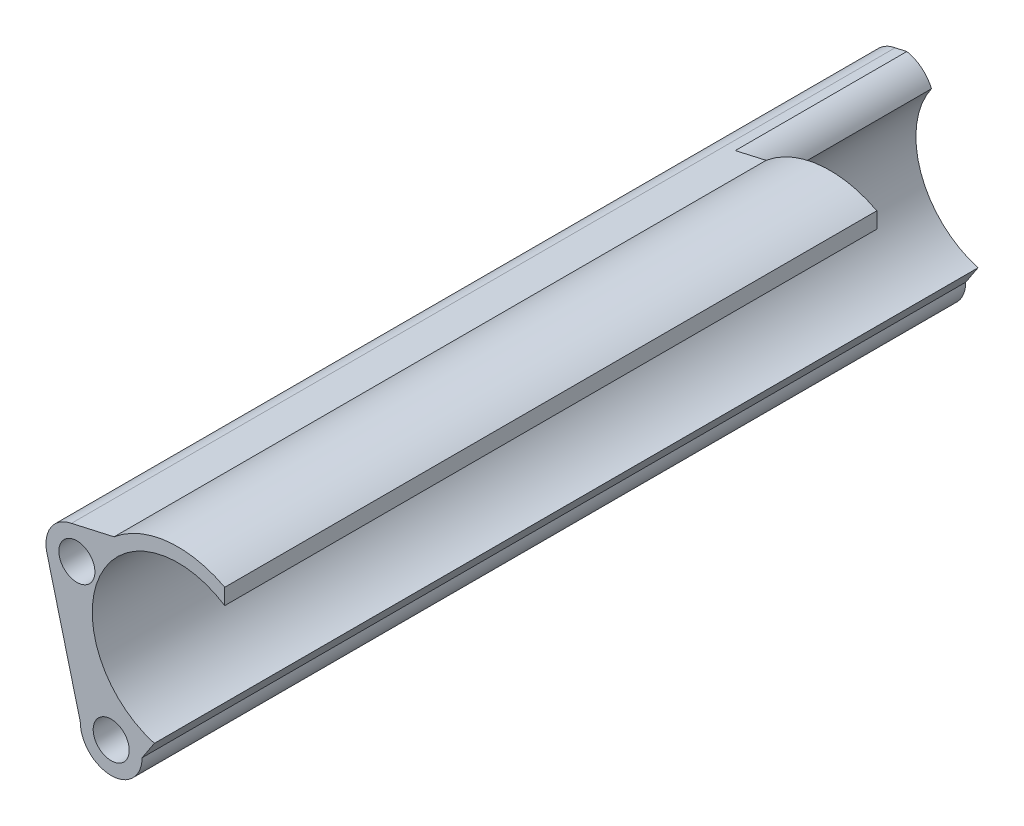
ISO-10303-21;
HEADER;
FILE_DESCRIPTION(('STEP AP214'),'2;1');
FILE_NAME('part.step','',(''),(''),'','','');
FILE_SCHEMA(('AUTOMOTIVE_DESIGN { 1 0 10303 214 1 1 1 1 }'));
ENDSEC;
DATA;
#1=APPLICATION_CONTEXT('core data for automotive mechanical design processes');
#2=APPLICATION_PROTOCOL_DEFINITION('international standard','automotive_design',2000,#1);
#3=PRODUCT_CONTEXT('',#1,'mechanical');
#4=PRODUCT('Part','Part','',(#3));
#5=PRODUCT_RELATED_PRODUCT_CATEGORY('part','',(#4));
#6=PRODUCT_DEFINITION_FORMATION('','',#4);
#7=PRODUCT_DEFINITION_CONTEXT('part definition',#1,'design');
#8=PRODUCT_DEFINITION('design','',#6,#7);
#9=PRODUCT_DEFINITION_SHAPE('','',#8);
#10=(LENGTH_UNIT() NAMED_UNIT(*) SI_UNIT(.MILLI.,.METRE.));
#11=(NAMED_UNIT(*) PLANE_ANGLE_UNIT() SI_UNIT($,.RADIAN.));
#12=(NAMED_UNIT(*) SI_UNIT($,.STERADIAN.) SOLID_ANGLE_UNIT());
#13=UNCERTAINTY_MEASURE_WITH_UNIT(LENGTH_MEASURE(1.E-05),#10,'distance_accuracy_value','');
#14=(GEOMETRIC_REPRESENTATION_CONTEXT(3) GLOBAL_UNCERTAINTY_ASSIGNED_CONTEXT((#13)) GLOBAL_UNIT_ASSIGNED_CONTEXT((#10,
#11,#12)) REPRESENTATION_CONTEXT('',''));
#15=CARTESIAN_POINT('',(0.,0.,0.));
#16=DIRECTION('',(0.,0.,1.));
#17=DIRECTION('',(1.,0.,0.));
#18=AXIS2_PLACEMENT_3D('',#15,#16,#17);
#19=CARTESIAN_POINT('',(21.5406787545616,4.51282461500229E-13,120.));
#20=DIRECTION('',(1.,0.,0.));
#21=DIRECTION('',(0.,1.,0.));
#22=AXIS2_PLACEMENT_3D('',#19,#20,#21);
#23=PLANE('',#22);
#24=DIRECTION('',(0.,0.,-1.));
#25=VECTOR('',#24,1.);
#26=CARTESIAN_POINT('',(21.5406787545615,5.21282360688181,120.));
#27=LINE('',#26,#25);
#28=CARTESIAN_POINT('',(21.5406787545615,5.21282360688181,120.));
#29=VERTEX_POINT('',#28);
#30=CARTESIAN_POINT('',(21.5406787545615,5.21282360688184,25.));
#31=VERTEX_POINT('',#30);
#32=EDGE_CURVE('E60',#29,#31,#27,.T.);
#33=ORIENTED_EDGE('',*,*,#32,.T.);
#34=DIRECTION('',(0.,1.,0.));
#35=VECTOR('',#34,1.);
#36=CARTESIAN_POINT('',(21.5406787545616,4.51282461500229E-13,25.));
#37=LINE('',#36,#35);
#38=CARTESIAN_POINT('',(21.5406787545615,7.53128151458365,25.));
#39=VERTEX_POINT('',#38);
#40=EDGE_CURVE('E196',#31,#39,#37,.T.);
#41=ORIENTED_EDGE('',*,*,#40,.T.);
#42=DIRECTION('',(0.,0.,-1.));
#43=VECTOR('',#42,1.);
#44=CARTESIAN_POINT('',(21.5406787545615,7.53128151458365,120.));
#45=LINE('',#44,#43);
#46=CARTESIAN_POINT('',(21.5406787545615,7.53128151458365,120.));
#47=VERTEX_POINT('',#46);
#48=EDGE_CURVE('E45',#47,#39,#45,.T.);
#49=ORIENTED_EDGE('',*,*,#48,.F.);
#50=DIRECTION('',(0.,-1.,0.));
#51=VECTOR('',#50,1.);
#52=CARTESIAN_POINT('',(21.5406787545616,4.51282461500229E-13,120.));
#53=LINE('',#52,#51);
#54=EDGE_CURVE('E215',#47,#29,#53,.T.);
#55=ORIENTED_EDGE('',*,*,#54,.T.);
#56=EDGE_LOOP('',(#33,#41,#49,#55));
#57=FACE_BOUND('',#56,.T.);
#58=ADVANCED_FACE('F37',(#57),#23,.T.);
#59=CARTESIAN_POINT('',(14.7374063577215,-5.27361929309128,120.));
#60=DIRECTION('',(0.,0.,-1.));
#61=DIRECTION('',(-1.,0.,0.));
#62=AXIS2_PLACEMENT_3D('',#59,#60,#61);
#63=CYLINDRICAL_SURFACE('',#62,14.5);
#64=CARTESIAN_POINT('',(14.7374063577215,-5.27361929309128,25.));
#65=DIRECTION('',(0.,0.,-1.));
#66=DIRECTION('',(-1.,0.,0.));
#67=AXIS2_PLACEMENT_3D('',#64,#65,#66);
#68=CIRCLE('',#67,14.5);
#69=CARTESIAN_POINT('',(5.41957654231586,5.83619832607499,25.));
#70=VERTEX_POINT('',#69);
#71=EDGE_CURVE('E176',#70,#39,#68,.T.);
#72=ORIENTED_EDGE('',*,*,#71,.F.);
#73=DIRECTION('',(0.,0.,-1.));
#74=VECTOR('',#73,1.);
#75=CARTESIAN_POINT('',(5.41957654231585,5.83619832607501,120.));
#76=LINE('',#75,#74);
#77=CARTESIAN_POINT('',(5.41957654231585,5.83619832607501,120.));
#78=VERTEX_POINT('',#77);
#79=EDGE_CURVE('E168',#78,#70,#76,.T.);
#80=ORIENTED_EDGE('',*,*,#79,.F.);
#81=CARTESIAN_POINT('',(14.7374063577215,-5.27361929309128,120.));
#82=DIRECTION('',(0.,0.,1.));
#83=DIRECTION('',(1.,0.,0.));
#84=AXIS2_PLACEMENT_3D('',#81,#82,#83);
#85=CIRCLE('',#84,14.5);
#86=EDGE_CURVE('E178',#47,#78,#85,.T.);
#87=ORIENTED_EDGE('',*,*,#86,.F.);
#88=ORIENTED_EDGE('',*,*,#48,.T.);
#89=EDGE_LOOP('',(#72,#80,#87,#88));
#90=FACE_BOUND('',#89,.T.);
#91=ADVANCED_FACE('F173',(#90),#63,.T.);
#92=CARTESIAN_POINT('',(-0.992590841324967,4.38460661520937,120.));
#93=DIRECTION('',(0.220793854202999,-0.975320498065218,0.));
#94=DIRECTION('',(0.975320498065218,0.220793854202999,0.));
#95=AXIS2_PLACEMENT_3D('',#92,#93,#94);
#96=PLANE('',#95);
#97=DIRECTION('',(0.975320498065218,0.220793854202999,0.));
#98=VECTOR('',#97,1.);
#99=CARTESIAN_POINT('',(-0.992590841324967,4.38460661520937,25.));
#100=LINE('',#99,#98);
#101=CARTESIAN_POINT('',(0.92004187852692,4.81758997886121,25.));
#102=VERTEX_POINT('',#101);
#103=EDGE_CURVE('E143',#102,#70,#100,.T.);
#104=ORIENTED_EDGE('',*,*,#103,.F.);
#105=DIRECTION('',(0.,0.,-1.));
#106=VECTOR('',#105,1.);
#107=CARTESIAN_POINT('',(0.92004187852692,4.81758997886121,25.));
#108=LINE('',#107,#106);
#109=CARTESIAN_POINT('',(0.920041878526919,4.81758997886121,0.));
#110=VERTEX_POINT('',#109);
#111=EDGE_CURVE('E199',#102,#110,#108,.T.);
#112=ORIENTED_EDGE('',*,*,#111,.T.);
#113=DIRECTION('',(-0.975320498065218,-0.220793854202999,0.));
#114=VECTOR('',#113,1.);
#115=CARTESIAN_POINT('',(-0.992590841324967,4.38460661520937,0.));
#116=LINE('',#115,#114);
#117=CARTESIAN_POINT('',(-0.797555390004435,4.42875890062602,0.));
#118=VERTEX_POINT('',#117);
#119=EDGE_CURVE('E146',#110,#118,#116,.T.);
#120=ORIENTED_EDGE('',*,*,#119,.T.);
#121=DIRECTION('',(0.,0.,-1.));
#122=VECTOR('',#121,1.);
#123=CARTESIAN_POINT('',(-0.797555390004435,4.42875890062602,120.));
#124=LINE('',#123,#122);
#125=CARTESIAN_POINT('',(-0.797555390004435,4.42875890062602,120.));
#126=VERTEX_POINT('',#125);
#127=EDGE_CURVE('E165',#126,#118,#124,.T.);
#128=ORIENTED_EDGE('',*,*,#127,.F.);
#129=DIRECTION('',(-0.975320498065218,-0.220793854202999,0.));
#130=VECTOR('',#129,1.);
#131=CARTESIAN_POINT('',(-0.992590841324967,4.38460661520937,120.));
#132=LINE('',#131,#130);
#133=EDGE_CURVE('E218',#78,#126,#132,.T.);
#134=ORIENTED_EDGE('',*,*,#133,.F.);
#135=ORIENTED_EDGE('',*,*,#79,.T.);
#136=EDGE_LOOP('',(#104,#112,#120,#128,#134,#135));
#137=FACE_BOUND('',#136,.T.);
#138=ADVANCED_FACE('F232',(#137),#96,.F.);
#139=CARTESIAN_POINT('',(0.,0.,120.));
#140=DIRECTION('',(0.,0.,-1.));
#141=DIRECTION('',(-1.,0.,0.));
#142=AXIS2_PLACEMENT_3D('',#139,#140,#141);
#143=CYLINDRICAL_SURFACE('',#142,4.49999999999992);
#144=CARTESIAN_POINT('',(0.,0.,0.));
#145=DIRECTION('',(0.,0.,1.));
#146=DIRECTION('',(1.,0.,0.));
#147=AXIS2_PLACEMENT_3D('',#144,#145,#146);
#148=CIRCLE('',#147,4.49999999999992);
#149=CARTESIAN_POINT('',(-4.3580211919194,-1.12145052979643,0.));
#150=VERTEX_POINT('',#149);
#151=EDGE_CURVE('E148',#118,#150,#148,.T.);
#152=ORIENTED_EDGE('',*,*,#151,.T.);
#153=DIRECTION('',(0.,0.,-1.));
#154=VECTOR('',#153,1.);
#155=CARTESIAN_POINT('',(-4.3580211919194,-1.12145052979643,120.));
#156=LINE('',#155,#154);
#157=CARTESIAN_POINT('',(-4.3580211919194,-1.12145052979643,120.));
#158=VERTEX_POINT('',#157);
#159=EDGE_CURVE('E162',#158,#150,#156,.T.);
#160=ORIENTED_EDGE('',*,*,#159,.F.);
#161=CARTESIAN_POINT('',(0.,0.,120.));
#162=DIRECTION('',(0.,0.,1.));
#163=DIRECTION('',(1.,0.,0.));
#164=AXIS2_PLACEMENT_3D('',#161,#162,#163);
#165=CIRCLE('',#164,4.49999999999992);
#166=EDGE_CURVE('E221',#126,#158,#165,.T.);
#167=ORIENTED_EDGE('',*,*,#166,.F.);
#168=ORIENTED_EDGE('',*,*,#127,.T.);
#169=EDGE_LOOP('',(#152,#160,#167,#168));
#170=FACE_BOUND('',#169,.T.);
#171=ADVANCED_FACE('F225',(#170),#143,.T.);
#172=CARTESIAN_POINT('',(-4.35802119191901,-1.12145052979794,120.));
#173=DIRECTION('',(0.968449153759797,0.249211228843991,0.));
#174=DIRECTION('',(-0.249211228843991,0.968449153759797,0.));
#175=AXIS2_PLACEMENT_3D('',#172,#173,#174);
#176=PLANE('',#175);
#177=DIRECTION('',(0.249211228843991,-0.968449153759797,0.));
#178=VECTOR('',#177,1.);
#179=CARTESIAN_POINT('',(-4.35802119191901,-1.12145052979794,0.));
#180=LINE('',#179,#178);
#181=CARTESIAN_POINT('',(0.500000000000005,-20.,0.));
#182=VERTEX_POINT('',#181);
#183=EDGE_CURVE('E151',#150,#182,#180,.T.);
#184=ORIENTED_EDGE('',*,*,#183,.T.);
#185=DIRECTION('',(0.,0.,-1.));
#186=VECTOR('',#185,1.);
#187=CARTESIAN_POINT('',(0.500000000000005,-20.,120.));
#188=LINE('',#187,#186);
#189=CARTESIAN_POINT('',(0.500000000000005,-20.,120.));
#190=VERTEX_POINT('',#189);
#191=EDGE_CURVE('E130',#190,#182,#188,.T.);
#192=ORIENTED_EDGE('',*,*,#191,.F.);
#193=DIRECTION('',(0.249211228843991,-0.968449153759797,0.));
#194=VECTOR('',#193,1.);
#195=CARTESIAN_POINT('',(-4.35802119191901,-1.12145052979794,120.));
#196=LINE('',#195,#194);
#197=EDGE_CURVE('E119',#158,#190,#196,.T.);
#198=ORIENTED_EDGE('',*,*,#197,.F.);
#199=ORIENTED_EDGE('',*,*,#159,.T.);
#200=EDGE_LOOP('',(#184,#192,#198,#199));
#201=FACE_BOUND('',#200,.T.);
#202=ADVANCED_FACE('F228',(#201),#176,.F.);
#203=CARTESIAN_POINT('',(5.,-20.,120.));
#204=DIRECTION('',(0.,0.,-1.));
#205=DIRECTION('',(-1.,0.,0.));
#206=AXIS2_PLACEMENT_3D('',#203,#204,#205);
#207=CYLINDRICAL_SURFACE('',#206,4.5);
#208=CARTESIAN_POINT('',(5.,-20.,0.));
#209=DIRECTION('',(0.,0.,1.));
#210=DIRECTION('',(1.,0.,0.));
#211=AXIS2_PLACEMENT_3D('',#208,#209,#210);
#212=CIRCLE('',#211,4.5);
#213=CARTESIAN_POINT('',(9.5,-20.,0.));
#214=VERTEX_POINT('',#213);
#215=EDGE_CURVE('E127',#182,#214,#212,.T.);
#216=ORIENTED_EDGE('',*,*,#215,.T.);
#217=DIRECTION('',(0.,0.,-1.));
#218=VECTOR('',#217,1.);
#219=CARTESIAN_POINT('',(9.5,-20.,120.));
#220=LINE('',#219,#218);
#221=CARTESIAN_POINT('',(9.5,-20.,120.));
#222=VERTEX_POINT('',#221);
#223=EDGE_CURVE('E125',#222,#214,#220,.T.);
#224=ORIENTED_EDGE('',*,*,#223,.F.);
#225=CARTESIAN_POINT('',(5.,-20.,120.));
#226=DIRECTION('',(0.,0.,1.));
#227=DIRECTION('',(1.,0.,0.));
#228=AXIS2_PLACEMENT_3D('',#225,#226,#227);
#229=CIRCLE('',#228,4.5);
#230=EDGE_CURVE('E111',#190,#222,#229,.T.);
#231=ORIENTED_EDGE('',*,*,#230,.F.);
#232=ORIENTED_EDGE('',*,*,#191,.T.);
#233=EDGE_LOOP('',(#216,#224,#231,#232));
#234=FACE_BOUND('',#233,.T.);
#235=ADVANCED_FACE('F126',(#234),#207,.T.);
#236=CARTESIAN_POINT('',(15.8131741889703,-10.4107028907879,120.));
#237=DIRECTION('',(0.835240024776836,-0.54988553446221,0.));
#238=DIRECTION('',(0.54988553446221,0.835240024776836,0.));
#239=AXIS2_PLACEMENT_3D('',#236,#237,#238);
#240=PLANE('',#239);
#241=DIRECTION('',(-0.54988553446221,-0.835240024776836,0.));
#242=VECTOR('',#241,1.);
#243=CARTESIAN_POINT('',(15.8131741889703,-10.4107028907879,0.));
#244=LINE('',#243,#242);
#245=CARTESIAN_POINT('',(11.2857217695841,-17.2876058714098,0.));
#246=VERTEX_POINT('',#245);
#247=EDGE_CURVE('E155',#246,#214,#244,.T.);
#248=ORIENTED_EDGE('',*,*,#247,.F.);
#249=DIRECTION('',(0.,0.,-1.));
#250=VECTOR('',#249,1.);
#251=CARTESIAN_POINT('',(11.2857217695841,-17.2876058714098,120.));
#252=LINE('',#251,#250);
#253=CARTESIAN_POINT('',(11.2857217695841,-17.2876058714098,120.));
#254=VERTEX_POINT('',#253);
#255=EDGE_CURVE('E131',#254,#246,#252,.T.);
#256=ORIENTED_EDGE('',*,*,#255,.F.);
#257=DIRECTION('',(-0.54988553446221,-0.835240024776836,0.));
#258=VECTOR('',#257,1.);
#259=CARTESIAN_POINT('',(15.8131741889703,-10.4107028907879,120.));
#260=LINE('',#259,#258);
#261=EDGE_CURVE('E117',#254,#222,#260,.T.);
#262=ORIENTED_EDGE('',*,*,#261,.T.);
#263=ORIENTED_EDGE('',*,*,#223,.T.);
#264=EDGE_LOOP('',(#248,#256,#262,#263));
#265=FACE_BOUND('',#264,.T.);
#266=ADVANCED_FACE('F133',(#265),#240,.T.);
#267=CARTESIAN_POINT('',(5.,-20.,120.));
#268=DIRECTION('',(0.,0.,-1.));
#269=DIRECTION('',(-1.,0.,0.));
#270=AXIS2_PLACEMENT_3D('',#267,#268,#269);
#271=CYLINDRICAL_SURFACE('',#270,2.625);
#272=CARTESIAN_POINT('',(5.,-20.,120.));
#273=DIRECTION('',(0.,0.,1.));
#274=DIRECTION('',(1.,0.,0.));
#275=AXIS2_PLACEMENT_3D('',#272,#273,#274);
#276=CIRCLE('',#275,2.625);
#277=CARTESIAN_POINT('',(7.625,-20.,120.));
#278=VERTEX_POINT('',#277);
#279=EDGE_CURVE('E212',#278,#278,#276,.T.);
#280=ORIENTED_EDGE('',*,*,#279,.T.);
#281=EDGE_LOOP('',(#280));
#282=FACE_BOUND('',#281,.T.);
#283=CARTESIAN_POINT('',(5.,-20.,0.));
#284=DIRECTION('',(0.,0.,1.));
#285=DIRECTION('',(1.,0.,0.));
#286=AXIS2_PLACEMENT_3D('',#283,#284,#285);
#287=CIRCLE('',#286,2.625);
#288=CARTESIAN_POINT('',(7.625,-20.,0.));
#289=VERTEX_POINT('',#288);
#290=EDGE_CURVE('E142',#289,#289,#287,.T.);
#291=ORIENTED_EDGE('',*,*,#290,.F.);
#292=EDGE_LOOP('',(#291));
#293=FACE_BOUND('',#292,.T.);
#294=ADVANCED_FACE('F240',(#282,#293),#271,.F.);
#295=CARTESIAN_POINT('',(0.,0.,120.));
#296=DIRECTION('',(0.,0.,-1.));
#297=DIRECTION('',(-1.,0.,0.));
#298=AXIS2_PLACEMENT_3D('',#295,#296,#297);
#299=CYLINDRICAL_SURFACE('',#298,2.625);
#300=CARTESIAN_POINT('',(0.,0.,120.));
#301=DIRECTION('',(0.,0.,1.));
#302=DIRECTION('',(1.,0.,0.));
#303=AXIS2_PLACEMENT_3D('',#300,#301,#302);
#304=CIRCLE('',#303,2.625);
#305=CARTESIAN_POINT('',(2.625,0.,120.));
#306=VERTEX_POINT('',#305);
#307=EDGE_CURVE('E158',#306,#306,#304,.T.);
#308=ORIENTED_EDGE('',*,*,#307,.T.);
#309=EDGE_LOOP('',(#308));
#310=FACE_BOUND('',#309,.T.);
#311=CARTESIAN_POINT('',(0.,0.,0.));
#312=DIRECTION('',(0.,0.,1.));
#313=DIRECTION('',(1.,0.,0.));
#314=AXIS2_PLACEMENT_3D('',#311,#312,#313);
#315=CIRCLE('',#314,2.625);
#316=CARTESIAN_POINT('',(2.625,0.,0.));
#317=VERTEX_POINT('',#316);
#318=EDGE_CURVE('E139',#317,#317,#315,.T.);
#319=ORIENTED_EDGE('',*,*,#318,.F.);
#320=EDGE_LOOP('',(#319));
#321=FACE_BOUND('',#320,.T.);
#322=ADVANCED_FACE('F39',(#310,#321),#299,.F.);
#323=CARTESIAN_POINT('',(14.7374063577215,-5.27361929309128,120.));
#324=DIRECTION('',(0.,0.,-1.));
#325=DIRECTION('',(-1.,0.,0.));
#326=AXIS2_PLACEMENT_3D('',#323,#324,#325);
#327=CYLINDRICAL_SURFACE('',#326,12.5000000000001);
#328=DIRECTION('',(0.,0.,-1.));
#329=VECTOR('',#328,1.);
#330=CARTESIAN_POINT('',(4.51381882510304,1.91861665707683,25.));
#331=LINE('',#330,#329);
#332=CARTESIAN_POINT('',(4.51381882510304,1.91861665707683,25.));
#333=VERTEX_POINT('',#332);
#334=CARTESIAN_POINT('',(4.51381882510301,1.91861665707683,0.));
#335=VERTEX_POINT('',#334);
#336=EDGE_CURVE('E52',#333,#335,#331,.T.);
#337=ORIENTED_EDGE('',*,*,#336,.F.);
#338=CARTESIAN_POINT('',(14.7374063577215,-5.27361929309128,25.));
#339=DIRECTION('',(0.,0.,-1.));
#340=DIRECTION('',(-1.,0.,0.));
#341=AXIS2_PLACEMENT_3D('',#338,#339,#340);
#342=CIRCLE('',#341,12.5000000000001);
#343=EDGE_CURVE('E11',#333,#31,#342,.T.);
#344=ORIENTED_EDGE('',*,*,#343,.T.);
#345=ORIENTED_EDGE('',*,*,#32,.F.);
#346=CARTESIAN_POINT('',(14.7374063577215,-5.27361929309128,120.));
#347=DIRECTION('',(0.,0.,1.));
#348=DIRECTION('',(1.,0.,0.));
#349=AXIS2_PLACEMENT_3D('',#346,#347,#348);
#350=CIRCLE('',#349,12.5000000000001);
#351=EDGE_CURVE('E134',#29,#254,#350,.T.);
#352=ORIENTED_EDGE('',*,*,#351,.T.);
#353=ORIENTED_EDGE('',*,*,#255,.T.);
#354=CARTESIAN_POINT('',(14.7374063577215,-5.27361929309128,0.));
#355=DIRECTION('',(0.,0.,1.));
#356=DIRECTION('',(1.,0.,0.));
#357=AXIS2_PLACEMENT_3D('',#354,#355,#356);
#358=CIRCLE('',#357,12.5000000000001);
#359=EDGE_CURVE('E85',#335,#246,#358,.T.);
#360=ORIENTED_EDGE('',*,*,#359,.F.);
#361=EDGE_LOOP('',(#337,#344,#345,#352,#353,#360));
#362=FACE_BOUND('',#361,.T.);
#363=ADVANCED_FACE('F202',(#362),#327,.F.);
#364=CARTESIAN_POINT('',(0.,0.,120.));
#365=DIRECTION('',(0.,0.,1.));
#366=DIRECTION('',(1.,0.,0.));
#367=AXIS2_PLACEMENT_3D('',#364,#365,#366);
#368=PLANE('',#367);
#369=ORIENTED_EDGE('',*,*,#307,.F.);
#370=EDGE_LOOP('',(#369));
#371=FACE_BOUND('',#370,.T.);
#372=ORIENTED_EDGE('',*,*,#279,.F.);
#373=EDGE_LOOP('',(#372));
#374=FACE_BOUND('',#373,.T.);
#375=ORIENTED_EDGE('',*,*,#54,.F.);
#376=ORIENTED_EDGE('',*,*,#86,.T.);
#377=ORIENTED_EDGE('',*,*,#133,.T.);
#378=ORIENTED_EDGE('',*,*,#166,.T.);
#379=ORIENTED_EDGE('',*,*,#197,.T.);
#380=ORIENTED_EDGE('',*,*,#230,.T.);
#381=ORIENTED_EDGE('',*,*,#261,.F.);
#382=ORIENTED_EDGE('',*,*,#351,.F.);
#383=EDGE_LOOP('',(#375,#376,#377,#378,#379,#380,#381,#382));
#384=FACE_BOUND('',#383,.T.);
#385=ADVANCED_FACE('F114',(#371,#374,#384),#368,.T.);
#386=CARTESIAN_POINT('',(0.,0.,0.));
#387=DIRECTION('',(0.,0.,1.));
#388=DIRECTION('',(1.,0.,0.));
#389=AXIS2_PLACEMENT_3D('',#386,#387,#388);
#390=PLANE('',#389);
#391=ORIENTED_EDGE('',*,*,#318,.T.);
#392=EDGE_LOOP('',(#391));
#393=FACE_BOUND('',#392,.T.);
#394=ORIENTED_EDGE('',*,*,#290,.T.);
#395=EDGE_LOOP('',(#394));
#396=FACE_BOUND('',#395,.T.);
#397=ORIENTED_EDGE('',*,*,#119,.F.);
#398=CARTESIAN_POINT('',(0.,0.,0.));
#399=DIRECTION('',(0.,0.,1.));
#400=DIRECTION('',(-1.,0.,0.));
#401=AXIS2_PLACEMENT_3D('',#398,#399,#400);
#402=CIRCLE('',#401,4.90465597801388);
#403=EDGE_CURVE('E200',#335,#110,#402,.T.);
#404=ORIENTED_EDGE('',*,*,#403,.F.);
#405=ORIENTED_EDGE('',*,*,#359,.T.);
#406=ORIENTED_EDGE('',*,*,#247,.T.);
#407=ORIENTED_EDGE('',*,*,#215,.F.);
#408=ORIENTED_EDGE('',*,*,#183,.F.);
#409=ORIENTED_EDGE('',*,*,#151,.F.);
#410=EDGE_LOOP('',(#397,#404,#405,#406,#407,#408,#409));
#411=FACE_BOUND('',#410,.T.);
#412=ADVANCED_FACE('F230',(#393,#396,#411),#390,.F.);
#413=CARTESIAN_POINT('',(0.,0.,25.));
#414=DIRECTION('',(0.,0.,-1.));
#415=DIRECTION('',(-1.,0.,0.));
#416=AXIS2_PLACEMENT_3D('',#413,#414,#415);
#417=PLANE('',#416);
#418=ORIENTED_EDGE('',*,*,#103,.T.);
#419=ORIENTED_EDGE('',*,*,#71,.T.);
#420=ORIENTED_EDGE('',*,*,#40,.F.);
#421=ORIENTED_EDGE('',*,*,#343,.F.);
#422=CARTESIAN_POINT('',(0.,0.,25.));
#423=DIRECTION('',(0.,0.,1.));
#424=DIRECTION('',(-1.,0.,0.));
#425=AXIS2_PLACEMENT_3D('',#422,#423,#424);
#426=CIRCLE('',#425,4.90465597801388);
#427=EDGE_CURVE('E194',#333,#102,#426,.T.);
#428=ORIENTED_EDGE('',*,*,#427,.T.);
#429=EDGE_LOOP('',(#418,#419,#420,#421,#428));
#430=FACE_BOUND('',#429,.T.);
#431=ADVANCED_FACE('F193',(#430),#417,.T.);
#432=CARTESIAN_POINT('',(0.,0.,25.));
#433=DIRECTION('',(0.,0.,-1.));
#434=DIRECTION('',(-1.,0.,0.));
#435=AXIS2_PLACEMENT_3D('',#432,#433,#434);
#436=CYLINDRICAL_SURFACE('',#435,4.90465597801388);
#437=ORIENTED_EDGE('',*,*,#427,.F.);
#438=ORIENTED_EDGE('',*,*,#336,.T.);
#439=ORIENTED_EDGE('',*,*,#403,.T.);
#440=ORIENTED_EDGE('',*,*,#111,.F.);
#441=EDGE_LOOP('',(#437,#438,#439,#440));
#442=FACE_BOUND('',#441,.T.);
#443=ADVANCED_FACE('F197',(#442),#436,.T.);
#444=CLOSED_SHELL('',(#58,#91,#138,#171,#202,#235,#266,#294,#322,#363,#385,#412,#431,#443));
#445=MANIFOLD_SOLID_BREP('B2',#444);
#446=ADVANCED_BREP_SHAPE_REPRESENTATION('',(#18,#445),#14);
#447=SHAPE_DEFINITION_REPRESENTATION(#9,#446);
ENDSEC;
END-ISO-10303-21;
